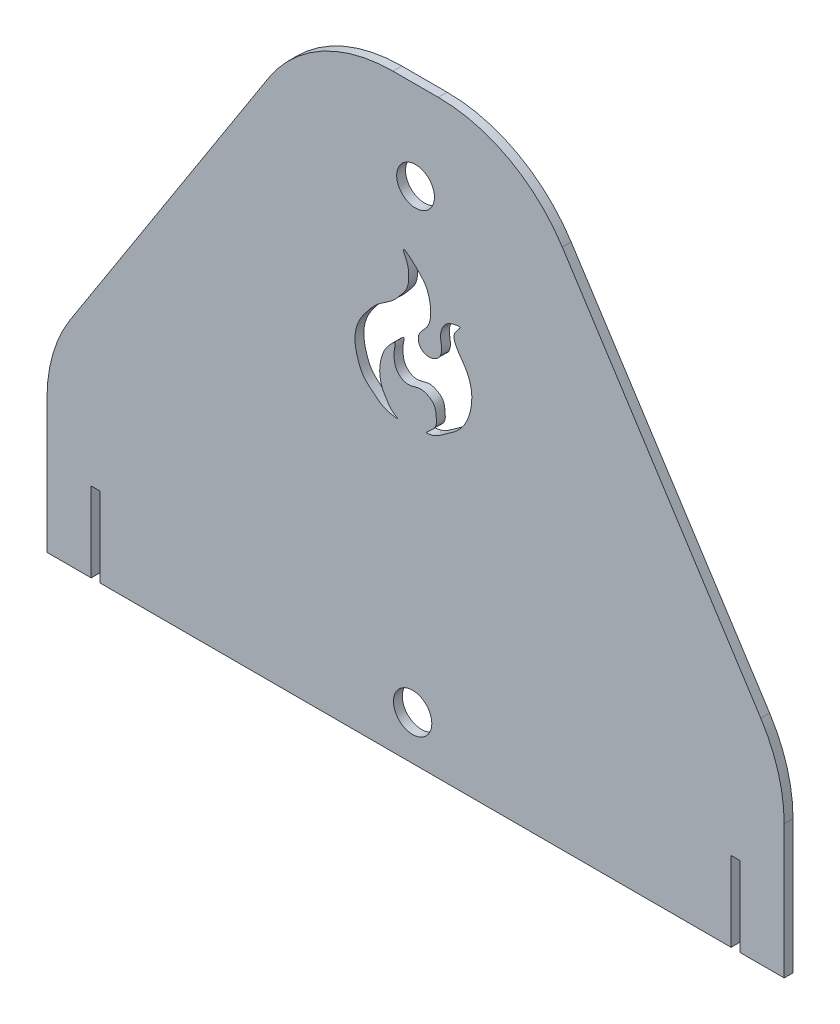
ISO-10303-21;
HEADER;
FILE_DESCRIPTION(('STEP AP214'),'2;1');
FILE_NAME('part.step','',(''),(''),'','','');
FILE_SCHEMA(('AUTOMOTIVE_DESIGN { 1 0 10303 214 1 1 1 1 }'));
ENDSEC;
DATA;
#1=APPLICATION_CONTEXT('core data for automotive mechanical design processes');
#2=APPLICATION_PROTOCOL_DEFINITION('international standard','automotive_design',2000,#1);
#3=PRODUCT_CONTEXT('',#1,'mechanical');
#4=PRODUCT('Part','Part','',(#3));
#5=PRODUCT_RELATED_PRODUCT_CATEGORY('part','',(#4));
#6=PRODUCT_DEFINITION_FORMATION('','',#4);
#7=PRODUCT_DEFINITION_CONTEXT('part definition',#1,'design');
#8=PRODUCT_DEFINITION('design','',#6,#7);
#9=PRODUCT_DEFINITION_SHAPE('','',#8);
#10=(LENGTH_UNIT() NAMED_UNIT(*) SI_UNIT(.MILLI.,.METRE.));
#11=(NAMED_UNIT(*) PLANE_ANGLE_UNIT() SI_UNIT($,.RADIAN.));
#12=(NAMED_UNIT(*) SI_UNIT($,.STERADIAN.) SOLID_ANGLE_UNIT());
#13=UNCERTAINTY_MEASURE_WITH_UNIT(LENGTH_MEASURE(1.E-05),#10,'distance_accuracy_value','');
#14=(GEOMETRIC_REPRESENTATION_CONTEXT(3) GLOBAL_UNCERTAINTY_ASSIGNED_CONTEXT((#13)) GLOBAL_UNIT_ASSIGNED_CONTEXT((#10,
#11,#12)) REPRESENTATION_CONTEXT('',''));
#15=CARTESIAN_POINT('',(0.,0.,0.));
#16=DIRECTION('',(0.,0.,1.));
#17=DIRECTION('',(1.,0.,0.));
#18=AXIS2_PLACEMENT_3D('',#15,#16,#17);
#19=CARTESIAN_POINT('',(0.,-100.,3.));
#20=DIRECTION('',(0.,1.,0.));
#21=DIRECTION('',(0.,0.,1.));
#22=AXIS2_PLACEMENT_3D('',#19,#20,#21);
#23=PLANE('',#22);
#24=DIRECTION('',(1.,0.,0.));
#25=VECTOR('',#24,1.);
#26=CARTESIAN_POINT('',(0.,-100.,3.));
#27=LINE('',#26,#25);
#28=CARTESIAN_POINT('',(110.,-100.,3.));
#29=VERTEX_POINT('',#28);
#30=CARTESIAN_POINT('',(125.,-100.,3.));
#31=VERTEX_POINT('',#30);
#32=EDGE_CURVE('E244',#29,#31,#27,.T.);
#33=ORIENTED_EDGE('',*,*,#32,.F.);
#34=DIRECTION('',(0.,0.,1.));
#35=VECTOR('',#34,1.);
#36=CARTESIAN_POINT('',(110.,-100.,0.));
#37=LINE('',#36,#35);
#38=CARTESIAN_POINT('',(110.,-100.,0.));
#39=VERTEX_POINT('',#38);
#40=EDGE_CURVE('E198',#39,#29,#37,.T.);
#41=ORIENTED_EDGE('',*,*,#40,.F.);
#42=DIRECTION('',(1.,0.,0.));
#43=VECTOR('',#42,1.);
#44=CARTESIAN_POINT('',(0.,-100.,0.));
#45=LINE('',#44,#43);
#46=CARTESIAN_POINT('',(125.,-100.,0.));
#47=VERTEX_POINT('',#46);
#48=EDGE_CURVE('E183',#39,#47,#45,.T.);
#49=ORIENTED_EDGE('',*,*,#48,.T.);
#50=DIRECTION('',(0.,0.,-1.));
#51=VECTOR('',#50,1.);
#52=CARTESIAN_POINT('',(125.,-100.,3.));
#53=LINE('',#52,#51);
#54=EDGE_CURVE('E252',#31,#47,#53,.T.);
#55=ORIENTED_EDGE('',*,*,#54,.F.);
#56=EDGE_LOOP('',(#33,#41,#49,#55));
#57=FACE_BOUND('',#56,.T.);
#58=ADVANCED_FACE('F37',(#57),#23,.F.);
#59=CARTESIAN_POINT('',(-125.,-100.,0.));
#60=VERTEX_POINT('',#59);
#61=CARTESIAN_POINT('',(-110.,-100.,0.));
#62=VERTEX_POINT('',#61);
#63=EDGE_CURVE('E266',#60,#62,#45,.T.);
#64=ORIENTED_EDGE('',*,*,#63,.T.);
#65=DIRECTION('',(0.,0.,1.));
#66=VECTOR('',#65,1.);
#67=CARTESIAN_POINT('',(-110.,-100.,0.));
#68=LINE('',#67,#66);
#69=CARTESIAN_POINT('',(-110.,-100.,3.));
#70=VERTEX_POINT('',#69);
#71=EDGE_CURVE('E213',#62,#70,#68,.T.);
#72=ORIENTED_EDGE('',*,*,#71,.T.);
#73=CARTESIAN_POINT('',(-125.,-100.,3.));
#74=VERTEX_POINT('',#73);
#75=EDGE_CURVE('E245',#74,#70,#27,.T.);
#76=ORIENTED_EDGE('',*,*,#75,.F.);
#77=DIRECTION('',(0.,0.,-1.));
#78=VECTOR('',#77,1.);
#79=CARTESIAN_POINT('',(-125.,-100.,3.));
#80=LINE('',#79,#78);
#81=EDGE_CURVE('E273',#74,#60,#80,.T.);
#82=ORIENTED_EDGE('',*,*,#81,.T.);
#83=EDGE_LOOP('',(#64,#72,#76,#82));
#84=FACE_BOUND('',#83,.T.);
#85=ADVANCED_FACE('F338',(#84),#23,.F.);
#86=CARTESIAN_POINT('',(70.2527075812274,45.1624548736462,3.));
#87=DIRECTION('',(0.841178475376554,0.540757591313499,0.));
#88=DIRECTION('',(-0.540757591313499,0.841178475376554,0.));
#89=AXIS2_PLACEMENT_3D('',#86,#87,#88);
#90=PLANE('',#89);
#91=DIRECTION('',(0.540757591313499,-0.841178475376554,0.));
#92=VECTOR('',#91,1.);
#93=CARTESIAN_POINT('',(70.2527075812274,45.1624548736462,3.));
#94=LINE('',#93,#92);
#95=CARTESIAN_POINT('',(49.7613631363518,77.0378795656749,3.));
#96=VERTEX_POINT('',#95);
#97=CARTESIAN_POINT('',(117.058923768828,-27.6472147515098,3.));
#98=VERTEX_POINT('',#97);
#99=EDGE_CURVE('E232',#96,#98,#94,.T.);
#100=ORIENTED_EDGE('',*,*,#99,.T.);
#101=DIRECTION('',(0.,0.,-1.));
#102=VECTOR('',#101,1.);
#103=CARTESIAN_POINT('',(117.058923768828,-27.6472147515098,3.));
#104=LINE('',#103,#102);
#105=CARTESIAN_POINT('',(117.058923768828,-27.6472147515098,0.));
#106=VERTEX_POINT('',#105);
#107=EDGE_CURVE('E302',#98,#106,#104,.T.);
#108=ORIENTED_EDGE('',*,*,#107,.T.);
#109=DIRECTION('',(0.540757591313499,-0.841178475376554,0.));
#110=VECTOR('',#109,1.);
#111=CARTESIAN_POINT('',(70.2527075812274,45.1624548736462,0.));
#112=LINE('',#111,#110);
#113=CARTESIAN_POINT('',(49.7613631363518,77.0378795656749,0.));
#114=VERTEX_POINT('',#113);
#115=EDGE_CURVE('E255',#114,#106,#112,.T.);
#116=ORIENTED_EDGE('',*,*,#115,.F.);
#117=DIRECTION('',(0.,0.,-1.));
#118=VECTOR('',#117,1.);
#119=CARTESIAN_POINT('',(49.7613631363518,77.0378795656749,3.));
#120=LINE('',#119,#118);
#121=EDGE_CURVE('E300',#114,#96,#120,.F.);
#122=ORIENTED_EDGE('',*,*,#121,.T.);
#123=EDGE_LOOP('',(#100,#108,#116,#122));
#124=FACE_BOUND('',#123,.T.);
#125=ADVANCED_FACE('F366',(#124),#90,.T.);
#126=CARTESIAN_POINT('',(0.,100.,3.));
#127=DIRECTION('',(0.,1.,0.));
#128=DIRECTION('',(0.,0.,1.));
#129=AXIS2_PLACEMENT_3D('',#126,#127,#128);
#130=PLANE('',#129);
#131=DIRECTION('',(1.,0.,0.));
#132=VECTOR('',#131,1.);
#133=CARTESIAN_POINT('',(0.,100.,3.));
#134=LINE('',#133,#132);
#135=CARTESIAN_POINT('',(-7.70243936752416,100.,3.));
#136=VERTEX_POINT('',#135);
#137=CARTESIAN_POINT('',(7.70243936752411,100.,3.));
#138=VERTEX_POINT('',#137);
#139=EDGE_CURVE('E236',#136,#138,#134,.T.);
#140=ORIENTED_EDGE('',*,*,#139,.T.);
#141=DIRECTION('',(0.,0.,-1.));
#142=VECTOR('',#141,1.);
#143=CARTESIAN_POINT('',(7.70243936752411,100.,3.));
#144=LINE('',#143,#142);
#145=CARTESIAN_POINT('',(7.70243936752411,100.,0.));
#146=VERTEX_POINT('',#145);
#147=EDGE_CURVE('E11',#138,#146,#144,.T.);
#148=ORIENTED_EDGE('',*,*,#147,.T.);
#149=DIRECTION('',(1.,0.,0.));
#150=VECTOR('',#149,1.);
#151=CARTESIAN_POINT('',(0.,100.,0.));
#152=LINE('',#151,#150);
#153=CARTESIAN_POINT('',(-7.70243936752416,100.,0.));
#154=VERTEX_POINT('',#153);
#155=EDGE_CURVE('E258',#154,#146,#152,.T.);
#156=ORIENTED_EDGE('',*,*,#155,.F.);
#157=DIRECTION('',(0.,0.,-1.));
#158=VECTOR('',#157,1.);
#159=CARTESIAN_POINT('',(-7.70243936752416,100.,3.));
#160=LINE('',#159,#158);
#161=EDGE_CURVE('E45',#154,#136,#160,.F.);
#162=ORIENTED_EDGE('',*,*,#161,.T.);
#163=EDGE_LOOP('',(#140,#148,#156,#162));
#164=FACE_BOUND('',#163,.T.);
#165=ADVANCED_FACE('F310',(#164),#130,.T.);
#166=CARTESIAN_POINT('',(-70.2527075812274,45.1624548736462,3.));
#167=DIRECTION('',(-0.841178475376553,0.540757591313499,0.));
#168=DIRECTION('',(-0.540757591313499,-0.841178475376554,0.));
#169=AXIS2_PLACEMENT_3D('',#166,#167,#168);
#170=PLANE('',#169);
#171=DIRECTION('',(0.540757591313499,0.841178475376554,0.));
#172=VECTOR('',#171,1.);
#173=CARTESIAN_POINT('',(-70.2527075812274,45.1624548736462,0.));
#174=LINE('',#173,#172);
#175=CARTESIAN_POINT('',(-117.058923768828,-27.6472147515097,0.));
#176=VERTEX_POINT('',#175);
#177=CARTESIAN_POINT('',(-49.7613631363518,77.0378795656749,0.));
#178=VERTEX_POINT('',#177);
#179=EDGE_CURVE('E261',#176,#178,#174,.T.);
#180=ORIENTED_EDGE('',*,*,#179,.F.);
#181=DIRECTION('',(0.,0.,-1.));
#182=VECTOR('',#181,1.);
#183=CARTESIAN_POINT('',(-117.058923768828,-27.6472147515097,3.));
#184=LINE('',#183,#182);
#185=CARTESIAN_POINT('',(-117.058923768828,-27.6472147515097,3.));
#186=VERTEX_POINT('',#185);
#187=EDGE_CURVE('E290',#176,#186,#184,.F.);
#188=ORIENTED_EDGE('',*,*,#187,.T.);
#189=DIRECTION('',(0.540757591313499,0.841178475376554,0.));
#190=VECTOR('',#189,1.);
#191=CARTESIAN_POINT('',(-70.2527075812274,45.1624548736462,3.));
#192=LINE('',#191,#190);
#193=CARTESIAN_POINT('',(-49.7613631363518,77.0378795656749,3.));
#194=VERTEX_POINT('',#193);
#195=EDGE_CURVE('E239',#186,#194,#192,.T.);
#196=ORIENTED_EDGE('',*,*,#195,.T.);
#197=DIRECTION('',(0.,0.,-1.));
#198=VECTOR('',#197,1.);
#199=CARTESIAN_POINT('',(-49.7613631363518,77.0378795656749,3.));
#200=LINE('',#199,#198);
#201=EDGE_CURVE('E287',#194,#178,#200,.T.);
#202=ORIENTED_EDGE('',*,*,#201,.T.);
#203=EDGE_LOOP('',(#180,#188,#196,#202));
#204=FACE_BOUND('',#203,.T.);
#205=ADVANCED_FACE('F323',(#204),#170,.T.);
#206=CARTESIAN_POINT('',(-125.,0.,3.));
#207=DIRECTION('',(1.,0.,0.));
#208=DIRECTION('',(0.,1.,0.));
#209=AXIS2_PLACEMENT_3D('',#206,#207,#208);
#210=PLANE('',#209);
#211=DIRECTION('',(0.,-1.,0.));
#212=VECTOR('',#211,1.);
#213=CARTESIAN_POINT('',(-125.,0.,3.));
#214=LINE('',#213,#212);
#215=CARTESIAN_POINT('',(-125.,-54.6850943171846,3.));
#216=VERTEX_POINT('',#215);
#217=EDGE_CURVE('E242',#216,#74,#214,.T.);
#218=ORIENTED_EDGE('',*,*,#217,.F.);
#219=DIRECTION('',(0.,0.,-1.));
#220=VECTOR('',#219,1.);
#221=CARTESIAN_POINT('',(-125.,-54.6850943171846,0.));
#222=LINE('',#221,#220);
#223=CARTESIAN_POINT('',(-125.,-54.6850943171846,0.));
#224=VERTEX_POINT('',#223);
#225=EDGE_CURVE('E276',#216,#224,#222,.T.);
#226=ORIENTED_EDGE('',*,*,#225,.T.);
#227=DIRECTION('',(0.,-1.,0.));
#228=VECTOR('',#227,1.);
#229=CARTESIAN_POINT('',(-125.,0.,0.));
#230=LINE('',#229,#228);
#231=EDGE_CURVE('E264',#224,#60,#230,.T.);
#232=ORIENTED_EDGE('',*,*,#231,.T.);
#233=ORIENTED_EDGE('',*,*,#81,.F.);
#234=EDGE_LOOP('',(#218,#226,#232,#233));
#235=FACE_BOUND('',#234,.T.);
#236=ADVANCED_FACE('F333',(#235),#210,.F.);
#237=CARTESIAN_POINT('',(-107.,-100.,0.));
#238=VERTEX_POINT('',#237);
#239=CARTESIAN_POINT('',(107.,-100.,0.));
#240=VERTEX_POINT('',#239);
#241=EDGE_CURVE('E269',#238,#240,#45,.T.);
#242=ORIENTED_EDGE('',*,*,#241,.T.);
#243=DIRECTION('',(0.,0.,1.));
#244=VECTOR('',#243,1.);
#245=CARTESIAN_POINT('',(107.,-100.,0.));
#246=LINE('',#245,#244);
#247=CARTESIAN_POINT('',(107.,-100.,3.));
#248=VERTEX_POINT('',#247);
#249=EDGE_CURVE('E201',#240,#248,#246,.T.);
#250=ORIENTED_EDGE('',*,*,#249,.T.);
#251=CARTESIAN_POINT('',(-107.,-100.,3.));
#252=VERTEX_POINT('',#251);
#253=EDGE_CURVE('E249',#252,#248,#27,.T.);
#254=ORIENTED_EDGE('',*,*,#253,.F.);
#255=DIRECTION('',(0.,0.,1.));
#256=VECTOR('',#255,1.);
#257=CARTESIAN_POINT('',(-107.,-100.,0.));
#258=LINE('',#257,#256);
#259=EDGE_CURVE('E225',#238,#252,#258,.T.);
#260=ORIENTED_EDGE('',*,*,#259,.F.);
#261=EDGE_LOOP('',(#242,#250,#254,#260));
#262=FACE_BOUND('',#261,.T.);
#263=ADVANCED_FACE('F350',(#262),#23,.F.);
#264=CARTESIAN_POINT('',(0.,70.,3.));
#265=DIRECTION('',(0.,0.,-1.));
#266=DIRECTION('',(-1.,0.,0.));
#267=AXIS2_PLACEMENT_3D('',#264,#265,#266);
#268=CYLINDRICAL_SURFACE('',#267,6.4);
#269=CARTESIAN_POINT('',(0.,70.,3.));
#270=DIRECTION('',(0.,0.,1.));
#271=DIRECTION('',(1.,0.,0.));
#272=AXIS2_PLACEMENT_3D('',#269,#270,#271);
#273=CIRCLE('',#272,6.4);
#274=CARTESIAN_POINT('',(6.39999999999995,70.,3.));
#275=VERTEX_POINT('',#274);
#276=EDGE_CURVE('E229',#275,#275,#273,.T.);
#277=ORIENTED_EDGE('',*,*,#276,.T.);
#278=EDGE_LOOP('',(#277));
#279=FACE_BOUND('',#278,.T.);
#280=CARTESIAN_POINT('',(0.,70.,0.));
#281=DIRECTION('',(0.,0.,1.));
#282=DIRECTION('',(1.,0.,0.));
#283=AXIS2_PLACEMENT_3D('',#280,#281,#282);
#284=CIRCLE('',#283,6.4);
#285=CARTESIAN_POINT('',(6.39999999999995,70.,0.));
#286=VERTEX_POINT('',#285);
#287=EDGE_CURVE('E222',#286,#286,#284,.T.);
#288=ORIENTED_EDGE('',*,*,#287,.F.);
#289=EDGE_LOOP('',(#288));
#290=FACE_BOUND('',#289,.T.);
#291=ADVANCED_FACE('F385',(#279,#290),#268,.F.);
#292=CARTESIAN_POINT('',(125.,0.,3.));
#293=DIRECTION('',(1.,0.,0.));
#294=DIRECTION('',(0.,1.,0.));
#295=AXIS2_PLACEMENT_3D('',#292,#293,#294);
#296=PLANE('',#295);
#297=DIRECTION('',(0.,-1.,0.));
#298=VECTOR('',#297,1.);
#299=CARTESIAN_POINT('',(125.,0.,0.));
#300=LINE('',#299,#298);
#301=CARTESIAN_POINT('',(125.,-54.6850943171847,0.));
#302=VERTEX_POINT('',#301);
#303=EDGE_CURVE('E233',#302,#47,#300,.T.);
#304=ORIENTED_EDGE('',*,*,#303,.F.);
#305=DIRECTION('',(0.,0.,-1.));
#306=VECTOR('',#305,1.);
#307=CARTESIAN_POINT('',(125.,-54.6850943171847,3.));
#308=LINE('',#307,#306);
#309=CARTESIAN_POINT('',(125.,-54.6850943171847,3.));
#310=VERTEX_POINT('',#309);
#311=EDGE_CURVE('E305',#302,#310,#308,.F.);
#312=ORIENTED_EDGE('',*,*,#311,.T.);
#313=DIRECTION('',(0.,-1.,0.));
#314=VECTOR('',#313,1.);
#315=CARTESIAN_POINT('',(125.,0.,3.));
#316=LINE('',#315,#314);
#317=EDGE_CURVE('E248',#310,#31,#316,.T.);
#318=ORIENTED_EDGE('',*,*,#317,.T.);
#319=ORIENTED_EDGE('',*,*,#54,.T.);
#320=EDGE_LOOP('',(#304,#312,#318,#319));
#321=FACE_BOUND('',#320,.T.);
#322=ADVANCED_FACE('F360',(#321),#296,.T.);
#323=CARTESIAN_POINT('',(0.,0.,3.));
#324=DIRECTION('',(0.,0.,1.));
#325=DIRECTION('',(1.,0.,0.));
#326=AXIS2_PLACEMENT_3D('',#323,#324,#325);
#327=PLANE('',#326);
#328=CARTESIAN_POINT('',(-0.999999999999987,-85.,3.));
#329=DIRECTION('',(0.,0.,1.));
#330=DIRECTION('',(1.,0.,0.));
#331=AXIS2_PLACEMENT_3D('',#328,#329,#330);
#332=CIRCLE('',#331,6.5);
#333=CARTESIAN_POINT('',(5.50000000000002,-85.,3.));
#334=VERTEX_POINT('',#333);
#335=EDGE_CURVE('E568',#334,#334,#332,.T.);
#336=ORIENTED_EDGE('',*,*,#335,.F.);
#337=EDGE_LOOP('',(#336));
#338=FACE_BOUND('',#337,.T.);
#339=CARTESIAN_POINT('',(-4.12725339671401,49.0959484469671,3.));
#340=CARTESIAN_POINT('',(-3.98707794969295,48.5465293594752,3.));
#341=CARTESIAN_POINT('',(-2.56154792500707,46.0235015709406,3.));
#342=CARTESIAN_POINT('',(-2.22360169040801,42.7831808845174,3.));
#343=CARTESIAN_POINT('',(-2.46538381453693,38.6612364866135,3.));
#344=CARTESIAN_POINT('',(-5.10503833260724,35.4720334912441,3.));
#345=CARTESIAN_POINT('',(-8.01681500923608,31.9589504181257,3.));
#346=CARTESIAN_POINT('',(-12.5492932982318,29.6768606026134,3.));
#347=CARTESIAN_POINT('',(-16.1389893501282,25.5373029322203,3.));
#348=CARTESIAN_POINT('',(-19.5571193880208,21.0626423139487,3.));
#349=CARTESIAN_POINT('',(-21.0143652570941,15.324992136359,3.));
#350=CARTESIAN_POINT('',(-19.8430561881023,10.0023436198541,3.));
#351=CARTESIAN_POINT('',(-17.9995434972235,5.07857505025242,3.));
#352=CARTESIAN_POINT('',(-13.5547666629663,1.67800809541478,3.));
#353=CARTESIAN_POINT('',(-10.8968295192266,-0.637239764509463,3.));
#354=CARTESIAN_POINT('',(-4.85431613423171,-1.70059907576659,3.));
#355=CARTESIAN_POINT('',(-8.52436173679336,0.199461893785471,3.));
#356=CARTESIAN_POINT('',(-9.5834237757312,2.2707244218301,3.));
#357=CARTESIAN_POINT('',(-11.4717053215345,5.03118445010933,3.));
#358=CARTESIAN_POINT('',(-12.2210732050776,8.32685950599297,3.));
#359=CARTESIAN_POINT('',(-12.1709086135857,11.7320350346255,3.));
#360=CARTESIAN_POINT('',(-11.1923589246509,15.3992184108924,3.));
#361=CARTESIAN_POINT('',(-10.0617483518492,17.8134479071054,3.));
#362=CARTESIAN_POINT('',(-6.44698519090501,21.6012675165652,3.));
#363=CARTESIAN_POINT('',(-7.32926682242971,18.2642493262938,3.));
#364=CARTESIAN_POINT('',(-7.35478032178391,16.4626112018925,3.));
#365=CARTESIAN_POINT('',(-7.15752582552984,15.1689811375015,3.));
#366=CARTESIAN_POINT('',(-7.01909850024471,13.8412187953574,3.));
#367=CARTESIAN_POINT('',(-5.97831782502443,12.1507380129293,3.));
#368=CARTESIAN_POINT('',(-4.4954541327037,10.9187757651564,3.));
#369=CARTESIAN_POINT('',(-2.72920796430243,10.5036594929682,3.));
#370=CARTESIAN_POINT('',(-0.700008666249059,10.7531556619096,3.));
#371=CARTESIAN_POINT('',(1.54726579070255,11.6841733957373,3.));
#372=CARTESIAN_POINT('',(4.253781924219,10.7980493525431,3.));
#373=CARTESIAN_POINT('',(6.7957034466938,8.95132695760773,3.));
#374=CARTESIAN_POINT('',(7.00836731261444,5.53802819933746,3.));
#375=CARTESIAN_POINT('',(7.30666589666588,2.10871319386036,3.));
#376=CARTESIAN_POINT('',(2.01639750528582,-1.09216902878568,3.));
#377=CARTESIAN_POINT('',(7.13968081730789,-0.0207215191973569,3.));
#378=CARTESIAN_POINT('',(9.50448389598061,2.09498890501786,3.));
#379=CARTESIAN_POINT('',(13.4297782983963,4.39853650923931,3.));
#380=CARTESIAN_POINT('',(17.0494990877415,8.36730891146637,3.));
#381=CARTESIAN_POINT('',(18.9977137772463,13.8219174932202,3.));
#382=CARTESIAN_POINT('',(19.2949027331674,19.8982352694827,3.));
#383=CARTESIAN_POINT('',(17.0835832339629,25.4045225890777,3.));
#384=CARTESIAN_POINT('',(14.0512344145749,28.8367550445736,3.));
#385=CARTESIAN_POINT('',(12.6563813410722,32.4523684440979,3.));
#386=CARTESIAN_POINT('',(13.6697440635928,34.3506521592627,3.));
#387=CARTESIAN_POINT('',(15.9552968634335,36.6231383779325,3.));
#388=CARTESIAN_POINT('',(11.8692486731837,35.7996200198742,3.));
#389=CARTESIAN_POINT('',(9.54573523394233,34.4084604400302,3.));
#390=CARTESIAN_POINT('',(8.12426283239527,30.821898129246,3.));
#391=CARTESIAN_POINT('',(8.90277250615677,27.5361356308487,3.));
#392=CARTESIAN_POINT('',(8.80183827732296,24.1342752813737,3.));
#393=CARTESIAN_POINT('',(6.2963971760399,22.2984932184813,3.));
#394=CARTESIAN_POINT('',(3.75880469421564,21.9907668914702,3.));
#395=CARTESIAN_POINT('',(1.56548509423479,23.2148650972399,3.));
#396=CARTESIAN_POINT('',(0.645683902285439,25.5574371214672,3.));
#397=CARTESIAN_POINT('',(1.44551686885422,28.2990549363111,3.));
#398=CARTESIAN_POINT('',(4.29908583102338,30.4110262511548,3.));
#399=CARTESIAN_POINT('',(5.51587751965564,35.0899875570148,3.));
#400=CARTESIAN_POINT('',(4.49982381028226,40.934602708109,3.));
#401=CARTESIAN_POINT('',(2.39650316305369,44.6254700172544,3.));
#402=CARTESIAN_POINT('',(-4.5182924223943,50.6286298774796,3.));
#403=CARTESIAN_POINT('',(-4.12725339671401,49.0959484469671,3.));
#404=B_SPLINE_CURVE_WITH_KNOTS('',3,(#339,#340,#341,#342,#343,#344,#345,#346,#347,#348,#349,
#350,#351,#352,#353,#354,#355,#356,#357,#358,#359,#360,#361,#362,#363,#364,#365,#366,#367,#368,
#369,#370,#371,#372,#373,#374,#375,#376,#377,#378,#379,#380,#381,#382,#383,#384,#385,#386,#387,
#388,#389,#390,#391,#392,#393,#394,#395,#396,#397,#398,#399,#400,#401,#402,#403),.UNSPECIFIED.,
.T.,.F.,(4,1,1,1,1,1,1,1,1,1,1,1,1,1,1,1,1,1,1,1,1,1,1,1,1,1,1,1,1,1,1,1,1,1,1,1,1,1,1,1,1,1,1,
1,1,1,1,1,1,1,1,1,1,1,1,1,1,1,1,1,1,1,4),(0.,0.011114111019035,0.0245873707818223,
0.0400773707193955,0.0550857900431032,0.0703646128201584,0.0916565839116477,0.111160034484304,
0.131942050183432,0.155226155463143,0.175285614912486,0.192984258002717,0.21414709386404,
0.233250826792014,0.245061707746368,0.252724431085502,0.26400469869646,0.274847542596833,
0.289360739598741,0.301591105017917,0.313643078156965,0.330068326454436,0.340960994138866,
0.347770076416226,0.357704028440235,0.359866782905986,0.369397621073736,0.378219282077832,
0.388786570706384,0.397662104950197,0.404600906339244,0.419429226672858,0.432660592344865,
0.445655664621459,0.464078809470296,0.47985721065022,0.499391806834321,0.512735468963105,
0.529774566860621,0.55429478669409,0.578004522368771,0.609803978884637,0.639155653653278,
0.668005658439941,0.695677007971753,0.709998366240669,0.720343400721268,0.730015674981377,
0.742142618477788,0.758246227570176,0.777479564094618,0.792731805865154,0.809819238537619,
0.824322515115591,0.835074277091286,0.846978051874076,0.859222355622795,0.869940813144779,
0.887577379141998,0.910066965194994,0.939312882476755,0.968995631998713,1.),.UNSPECIFIED.);
#405=CARTESIAN_POINT('',(-4.12725339671401,49.0959484469671,3.));
#406=VERTEX_POINT('',#405);
#407=EDGE_CURVE('E189',#406,#406,#404,.T.);
#408=ORIENTED_EDGE('',*,*,#407,.F.);
#409=EDGE_LOOP('',(#408));
#410=FACE_BOUND('',#409,.T.);
#411=DIRECTION('',(0.,1.,0.));
#412=VECTOR('',#411,1.);
#413=CARTESIAN_POINT('',(110.,-100.,3.));
#414=LINE('',#413,#412);
#415=CARTESIAN_POINT('',(110.,-73.0000000000001,3.));
#416=VERTEX_POINT('',#415);
#417=EDGE_CURVE('E168',#29,#416,#414,.T.);
#418=ORIENTED_EDGE('',*,*,#417,.F.);
#419=ORIENTED_EDGE('',*,*,#32,.T.);
#420=ORIENTED_EDGE('',*,*,#317,.F.);
#421=CARTESIAN_POINT('',(75.,-54.6850943171847,3.));
#422=DIRECTION('',(0.,0.,1.));
#423=DIRECTION('',(1.,0.,0.));
#424=AXIS2_PLACEMENT_3D('',#421,#422,#423);
#425=CIRCLE('',#424,50.);
#426=EDGE_CURVE('E296',#310,#98,#425,.T.);
#427=ORIENTED_EDGE('',*,*,#426,.T.);
#428=ORIENTED_EDGE('',*,*,#99,.F.);
#429=CARTESIAN_POINT('',(7.70243936752411,50.,3.));
#430=DIRECTION('',(0.,0.,1.));
#431=DIRECTION('',(1.,0.,0.));
#432=AXIS2_PLACEMENT_3D('',#429,#430,#431);
#433=CIRCLE('',#432,50.);
#434=EDGE_CURVE('E294',#96,#138,#433,.T.);
#435=ORIENTED_EDGE('',*,*,#434,.T.);
#436=ORIENTED_EDGE('',*,*,#139,.F.);
#437=CARTESIAN_POINT('',(-7.70243936752416,50.,3.));
#438=DIRECTION('',(0.,0.,1.));
#439=DIRECTION('',(1.,0.,0.));
#440=AXIS2_PLACEMENT_3D('',#437,#438,#439);
#441=CIRCLE('',#440,50.);
#442=EDGE_CURVE('E292',#136,#194,#441,.T.);
#443=ORIENTED_EDGE('',*,*,#442,.T.);
#444=ORIENTED_EDGE('',*,*,#195,.F.);
#445=CARTESIAN_POINT('',(-75.,-54.6850943171846,3.));
#446=DIRECTION('',(0.,0.,1.));
#447=DIRECTION('',(1.,0.,0.));
#448=AXIS2_PLACEMENT_3D('',#445,#446,#447);
#449=CIRCLE('',#448,50.);
#450=EDGE_CURVE('E298',#186,#216,#449,.T.);
#451=ORIENTED_EDGE('',*,*,#450,.T.);
#452=ORIENTED_EDGE('',*,*,#217,.T.);
#453=ORIENTED_EDGE('',*,*,#75,.T.);
#454=DIRECTION('',(0.,-1.,0.));
#455=VECTOR('',#454,1.);
#456=CARTESIAN_POINT('',(-110.,-100.,3.));
#457=LINE('',#456,#455);
#458=CARTESIAN_POINT('',(-110.,-73.0000000000001,3.));
#459=VERTEX_POINT('',#458);
#460=EDGE_CURVE('E200',#459,#70,#457,.T.);
#461=ORIENTED_EDGE('',*,*,#460,.F.);
#462=DIRECTION('',(-1.,0.,0.));
#463=VECTOR('',#462,1.);
#464=CARTESIAN_POINT('',(-110.,-73.0000000000001,3.));
#465=LINE('',#464,#463);
#466=CARTESIAN_POINT('',(-107.,-73.0000000000001,3.));
#467=VERTEX_POINT('',#466);
#468=EDGE_CURVE('E209',#467,#459,#465,.T.);
#469=ORIENTED_EDGE('',*,*,#468,.F.);
#470=DIRECTION('',(0.,1.,0.));
#471=VECTOR('',#470,1.);
#472=CARTESIAN_POINT('',(-107.,-100.,3.));
#473=LINE('',#472,#471);
#474=EDGE_CURVE('E215',#252,#467,#473,.T.);
#475=ORIENTED_EDGE('',*,*,#474,.F.);
#476=ORIENTED_EDGE('',*,*,#253,.T.);
#477=DIRECTION('',(0.,-1.,0.));
#478=VECTOR('',#477,1.);
#479=CARTESIAN_POINT('',(107.,-100.,3.));
#480=LINE('',#479,#478);
#481=CARTESIAN_POINT('',(107.,-73.0000000000001,3.));
#482=VERTEX_POINT('',#481);
#483=EDGE_CURVE('E184',#482,#248,#480,.T.);
#484=ORIENTED_EDGE('',*,*,#483,.F.);
#485=DIRECTION('',(-1.,0.,0.));
#486=VECTOR('',#485,1.);
#487=CARTESIAN_POINT('',(110.,-73.0000000000001,3.));
#488=LINE('',#487,#486);
#489=EDGE_CURVE('E186',#416,#482,#488,.T.);
#490=ORIENTED_EDGE('',*,*,#489,.F.);
#491=EDGE_LOOP('',(#418,#419,#420,#427,#428,#435,#436,#443,#444,#451,#452,#453,#461,#469,#475,
#476,#484,#490));
#492=FACE_BOUND('',#491,.T.);
#493=ORIENTED_EDGE('',*,*,#276,.F.);
#494=EDGE_LOOP('',(#493));
#495=FACE_BOUND('',#494,.T.);
#496=ADVANCED_FACE('F315',(#338,#410,#492,#495),#327,.T.);
#497=CARTESIAN_POINT('',(0.,0.,0.));
#498=DIRECTION('',(0.,0.,1.));
#499=DIRECTION('',(1.,0.,0.));
#500=AXIS2_PLACEMENT_3D('',#497,#498,#499);
#501=PLANE('',#500);
#502=CARTESIAN_POINT('',(-0.999999999999987,-85.,0.));
#503=DIRECTION('',(0.,0.,1.));
#504=DIRECTION('',(1.,0.,0.));
#505=AXIS2_PLACEMENT_3D('',#502,#503,#504);
#506=CIRCLE('',#505,6.5);
#507=CARTESIAN_POINT('',(5.50000000000002,-85.,0.));
#508=VERTEX_POINT('',#507);
#509=EDGE_CURVE('E574',#508,#508,#506,.T.);
#510=ORIENTED_EDGE('',*,*,#509,.T.);
#511=EDGE_LOOP('',(#510));
#512=FACE_BOUND('',#511,.T.);
#513=CARTESIAN_POINT('',(-4.12725339671401,49.0959484469671,0.));
#514=CARTESIAN_POINT('',(-3.98707794969295,48.5465293594752,0.));
#515=CARTESIAN_POINT('',(-2.56154792500707,46.0235015709406,0.));
#516=CARTESIAN_POINT('',(-2.22360169040801,42.7831808845174,0.));
#517=CARTESIAN_POINT('',(-2.46538381453693,38.6612364866135,0.));
#518=CARTESIAN_POINT('',(-5.10503833260724,35.4720334912441,0.));
#519=CARTESIAN_POINT('',(-8.01681500923608,31.9589504181257,0.));
#520=CARTESIAN_POINT('',(-12.5492932982318,29.6768606026134,0.));
#521=CARTESIAN_POINT('',(-16.1389893501282,25.5373029322203,0.));
#522=CARTESIAN_POINT('',(-19.5571193880208,21.0626423139487,0.));
#523=CARTESIAN_POINT('',(-21.0143652570941,15.324992136359,0.));
#524=CARTESIAN_POINT('',(-19.8430561881023,10.0023436198541,0.));
#525=CARTESIAN_POINT('',(-17.9995434972235,5.07857505025242,0.));
#526=CARTESIAN_POINT('',(-13.5547666629663,1.67800809541478,0.));
#527=CARTESIAN_POINT('',(-10.8968295192266,-0.637239764509463,0.));
#528=CARTESIAN_POINT('',(-4.85431613423171,-1.70059907576659,0.));
#529=CARTESIAN_POINT('',(-8.52436173679336,0.199461893785471,0.));
#530=CARTESIAN_POINT('',(-9.5834237757312,2.2707244218301,0.));
#531=CARTESIAN_POINT('',(-11.4717053215345,5.03118445010933,0.));
#532=CARTESIAN_POINT('',(-12.2210732050776,8.32685950599297,0.));
#533=CARTESIAN_POINT('',(-12.1709086135857,11.7320350346255,0.));
#534=CARTESIAN_POINT('',(-11.1923589246509,15.3992184108924,0.));
#535=CARTESIAN_POINT('',(-10.0617483518492,17.8134479071054,0.));
#536=CARTESIAN_POINT('',(-6.44698519090501,21.6012675165652,0.));
#537=CARTESIAN_POINT('',(-7.32926682242971,18.2642493262938,0.));
#538=CARTESIAN_POINT('',(-7.35478032178391,16.4626112018925,0.));
#539=CARTESIAN_POINT('',(-7.15752582552984,15.1689811375015,0.));
#540=CARTESIAN_POINT('',(-7.01909850024471,13.8412187953574,0.));
#541=CARTESIAN_POINT('',(-5.97831782502443,12.1507380129293,0.));
#542=CARTESIAN_POINT('',(-4.4954541327037,10.9187757651564,0.));
#543=CARTESIAN_POINT('',(-2.72920796430243,10.5036594929682,0.));
#544=CARTESIAN_POINT('',(-0.700008666249059,10.7531556619096,0.));
#545=CARTESIAN_POINT('',(1.54726579070255,11.6841733957373,0.));
#546=CARTESIAN_POINT('',(4.253781924219,10.7980493525431,0.));
#547=CARTESIAN_POINT('',(6.7957034466938,8.95132695760773,0.));
#548=CARTESIAN_POINT('',(7.00836731261444,5.53802819933746,0.));
#549=CARTESIAN_POINT('',(7.30666589666588,2.10871319386036,0.));
#550=CARTESIAN_POINT('',(2.01639750528582,-1.09216902878568,0.));
#551=CARTESIAN_POINT('',(7.13968081730789,-0.0207215191973569,0.));
#552=CARTESIAN_POINT('',(9.50448389598061,2.09498890501786,0.));
#553=CARTESIAN_POINT('',(13.4297782983963,4.39853650923931,0.));
#554=CARTESIAN_POINT('',(17.0494990877415,8.36730891146637,0.));
#555=CARTESIAN_POINT('',(18.9977137772463,13.8219174932202,0.));
#556=CARTESIAN_POINT('',(19.2949027331674,19.8982352694827,0.));
#557=CARTESIAN_POINT('',(17.0835832339629,25.4045225890777,0.));
#558=CARTESIAN_POINT('',(14.0512344145749,28.8367550445736,0.));
#559=CARTESIAN_POINT('',(12.6563813410722,32.4523684440979,0.));
#560=CARTESIAN_POINT('',(13.6697440635928,34.3506521592627,0.));
#561=CARTESIAN_POINT('',(15.9552968634335,36.6231383779325,0.));
#562=CARTESIAN_POINT('',(11.8692486731837,35.7996200198742,0.));
#563=CARTESIAN_POINT('',(9.54573523394233,34.4084604400302,0.));
#564=CARTESIAN_POINT('',(8.12426283239527,30.821898129246,0.));
#565=CARTESIAN_POINT('',(8.90277250615677,27.5361356308487,0.));
#566=CARTESIAN_POINT('',(8.80183827732296,24.1342752813737,0.));
#567=CARTESIAN_POINT('',(6.2963971760399,22.2984932184813,0.));
#568=CARTESIAN_POINT('',(3.75880469421564,21.9907668914702,0.));
#569=CARTESIAN_POINT('',(1.56548509423479,23.2148650972399,0.));
#570=CARTESIAN_POINT('',(0.645683902285439,25.5574371214672,0.));
#571=CARTESIAN_POINT('',(1.44551686885422,28.2990549363111,0.));
#572=CARTESIAN_POINT('',(4.29908583102338,30.4110262511548,0.));
#573=CARTESIAN_POINT('',(5.51587751965564,35.0899875570148,0.));
#574=CARTESIAN_POINT('',(4.49982381028226,40.934602708109,0.));
#575=CARTESIAN_POINT('',(2.39650316305369,44.6254700172544,0.));
#576=CARTESIAN_POINT('',(-4.5182924223943,50.6286298774796,0.));
#577=CARTESIAN_POINT('',(-4.12725339671401,49.0959484469671,0.));
#578=B_SPLINE_CURVE_WITH_KNOTS('',3,(#513,#514,#515,#516,#517,#518,#519,#520,#521,#522,#523,
#524,#525,#526,#527,#528,#529,#530,#531,#532,#533,#534,#535,#536,#537,#538,#539,#540,#541,#542,
#543,#544,#545,#546,#547,#548,#549,#550,#551,#552,#553,#554,#555,#556,#557,#558,#559,#560,#561,
#562,#563,#564,#565,#566,#567,#568,#569,#570,#571,#572,#573,#574,#575,#576,#577),.UNSPECIFIED.,
.T.,.F.,(4,1,1,1,1,1,1,1,1,1,1,1,1,1,1,1,1,1,1,1,1,1,1,1,1,1,1,1,1,1,1,1,1,1,1,1,1,1,1,1,1,1,1,
1,1,1,1,1,1,1,1,1,1,1,1,1,1,1,1,1,1,1,4),(0.,0.011114111019035,0.0245873707818223,
0.0400773707193955,0.0550857900431032,0.0703646128201584,0.0916565839116477,0.111160034484304,
0.131942050183432,0.155226155463143,0.175285614912486,0.192984258002717,0.21414709386404,
0.233250826792014,0.245061707746368,0.252724431085502,0.26400469869646,0.274847542596833,
0.289360739598741,0.301591105017917,0.313643078156965,0.330068326454436,0.340960994138866,
0.347770076416226,0.357704028440235,0.359866782905986,0.369397621073736,0.378219282077832,
0.388786570706384,0.397662104950197,0.404600906339244,0.419429226672858,0.432660592344865,
0.445655664621459,0.464078809470296,0.47985721065022,0.499391806834321,0.512735468963105,
0.529774566860621,0.55429478669409,0.578004522368771,0.609803978884637,0.639155653653278,
0.668005658439941,0.695677007971753,0.709998366240669,0.720343400721268,0.730015674981377,
0.742142618477788,0.758246227570176,0.777479564094618,0.792731805865154,0.809819238537619,
0.824322515115591,0.835074277091286,0.846978051874076,0.859222355622795,0.869940813144779,
0.887577379141998,0.910066965194994,0.939312882476755,0.968995631998713,1.),.UNSPECIFIED.);
#579=CARTESIAN_POINT('',(-4.12725339671401,49.0959484469671,0.));
#580=VERTEX_POINT('',#579);
#581=EDGE_CURVE('E196',#580,#580,#578,.T.);
#582=ORIENTED_EDGE('',*,*,#581,.T.);
#583=EDGE_LOOP('',(#582));
#584=FACE_BOUND('',#583,.T.);
#585=ORIENTED_EDGE('',*,*,#48,.F.);
#586=DIRECTION('',(0.,1.,0.));
#587=VECTOR('',#586,1.);
#588=CARTESIAN_POINT('',(110.,-100.,0.));
#589=LINE('',#588,#587);
#590=CARTESIAN_POINT('',(110.,-73.0000000000001,0.));
#591=VERTEX_POINT('',#590);
#592=EDGE_CURVE('E165',#39,#591,#589,.T.);
#593=ORIENTED_EDGE('',*,*,#592,.T.);
#594=DIRECTION('',(-1.,0.,0.));
#595=VECTOR('',#594,1.);
#596=CARTESIAN_POINT('',(110.,-73.0000000000001,0.));
#597=LINE('',#596,#595);
#598=CARTESIAN_POINT('',(107.,-73.0000000000001,0.));
#599=VERTEX_POINT('',#598);
#600=EDGE_CURVE('E175',#591,#599,#597,.T.);
#601=ORIENTED_EDGE('',*,*,#600,.T.);
#602=DIRECTION('',(0.,-1.,0.));
#603=VECTOR('',#602,1.);
#604=CARTESIAN_POINT('',(107.,-100.,0.));
#605=LINE('',#604,#603);
#606=EDGE_CURVE('E52',#599,#240,#605,.T.);
#607=ORIENTED_EDGE('',*,*,#606,.T.);
#608=ORIENTED_EDGE('',*,*,#241,.F.);
#609=DIRECTION('',(0.,1.,0.));
#610=VECTOR('',#609,1.);
#611=CARTESIAN_POINT('',(-107.,-100.,0.));
#612=LINE('',#611,#610);
#613=CARTESIAN_POINT('',(-107.,-73.0000000000001,0.));
#614=VERTEX_POINT('',#613);
#615=EDGE_CURVE('E208',#238,#614,#612,.T.);
#616=ORIENTED_EDGE('',*,*,#615,.T.);
#617=DIRECTION('',(-1.,0.,0.));
#618=VECTOR('',#617,1.);
#619=CARTESIAN_POINT('',(-110.,-73.0000000000001,0.));
#620=LINE('',#619,#618);
#621=CARTESIAN_POINT('',(-110.,-73.0000000000001,0.));
#622=VERTEX_POINT('',#621);
#623=EDGE_CURVE('E60',#614,#622,#620,.T.);
#624=ORIENTED_EDGE('',*,*,#623,.T.);
#625=DIRECTION('',(0.,-1.,0.));
#626=VECTOR('',#625,1.);
#627=CARTESIAN_POINT('',(-110.,-100.,0.));
#628=LINE('',#627,#626);
#629=EDGE_CURVE('E205',#622,#62,#628,.T.);
#630=ORIENTED_EDGE('',*,*,#629,.T.);
#631=ORIENTED_EDGE('',*,*,#63,.F.);
#632=ORIENTED_EDGE('',*,*,#231,.F.);
#633=CARTESIAN_POINT('',(-75.,-54.6850943171846,0.));
#634=DIRECTION('',(0.,0.,1.));
#635=DIRECTION('',(1.,0.,0.));
#636=AXIS2_PLACEMENT_3D('',#633,#634,#635);
#637=CIRCLE('',#636,50.);
#638=EDGE_CURVE('E285',#224,#176,#637,.F.);
#639=ORIENTED_EDGE('',*,*,#638,.T.);
#640=ORIENTED_EDGE('',*,*,#179,.T.);
#641=CARTESIAN_POINT('',(-7.70243936752416,50.,0.));
#642=DIRECTION('',(0.,0.,1.));
#643=DIRECTION('',(1.,0.,0.));
#644=AXIS2_PLACEMENT_3D('',#641,#642,#643);
#645=CIRCLE('',#644,50.);
#646=EDGE_CURVE('E279',#178,#154,#645,.F.);
#647=ORIENTED_EDGE('',*,*,#646,.T.);
#648=ORIENTED_EDGE('',*,*,#155,.T.);
#649=CARTESIAN_POINT('',(7.70243936752411,50.,0.));
#650=DIRECTION('',(0.,0.,1.));
#651=DIRECTION('',(1.,0.,0.));
#652=AXIS2_PLACEMENT_3D('',#649,#650,#651);
#653=CIRCLE('',#652,50.);
#654=EDGE_CURVE('E281',#146,#114,#653,.F.);
#655=ORIENTED_EDGE('',*,*,#654,.T.);
#656=ORIENTED_EDGE('',*,*,#115,.T.);
#657=CARTESIAN_POINT('',(75.,-54.6850943171847,0.));
#658=DIRECTION('',(0.,0.,1.));
#659=DIRECTION('',(1.,0.,0.));
#660=AXIS2_PLACEMENT_3D('',#657,#658,#659);
#661=CIRCLE('',#660,50.);
#662=EDGE_CURVE('E283',#106,#302,#661,.F.);
#663=ORIENTED_EDGE('',*,*,#662,.T.);
#664=ORIENTED_EDGE('',*,*,#303,.T.);
#665=EDGE_LOOP('',(#585,#593,#601,#607,#608,#616,#624,#630,#631,#632,#639,#640,#647,#648,#655,
#656,#663,#664));
#666=FACE_BOUND('',#665,.T.);
#667=ORIENTED_EDGE('',*,*,#287,.T.);
#668=EDGE_LOOP('',(#667));
#669=FACE_BOUND('',#668,.T.);
#670=ADVANCED_FACE('F180',(#512,#584,#666,#669),#501,.F.);
#671=CARTESIAN_POINT('',(-75.,-54.6850943171846,3.));
#672=DIRECTION('',(0.,0.,1.));
#673=DIRECTION('',(1.,0.,0.));
#674=AXIS2_PLACEMENT_3D('',#671,#672,#673);
#675=CYLINDRICAL_SURFACE('',#674,50.);
#676=ORIENTED_EDGE('',*,*,#450,.F.);
#677=ORIENTED_EDGE('',*,*,#187,.F.);
#678=ORIENTED_EDGE('',*,*,#638,.F.);
#679=ORIENTED_EDGE('',*,*,#225,.F.);
#680=EDGE_LOOP('',(#676,#677,#678,#679));
#681=FACE_BOUND('',#680,.T.);
#682=ADVANCED_FACE('F330',(#681),#675,.T.);
#683=CARTESIAN_POINT('',(75.,-54.6850943171847,3.));
#684=DIRECTION('',(0.,0.,-1.));
#685=DIRECTION('',(-1.,0.,0.));
#686=AXIS2_PLACEMENT_3D('',#683,#684,#685);
#687=CYLINDRICAL_SURFACE('',#686,50.);
#688=ORIENTED_EDGE('',*,*,#426,.F.);
#689=ORIENTED_EDGE('',*,*,#311,.F.);
#690=ORIENTED_EDGE('',*,*,#662,.F.);
#691=ORIENTED_EDGE('',*,*,#107,.F.);
#692=EDGE_LOOP('',(#688,#689,#690,#691));
#693=FACE_BOUND('',#692,.T.);
#694=ADVANCED_FACE('F363',(#693),#687,.T.);
#695=CARTESIAN_POINT('',(7.70243936752411,50.,3.));
#696=DIRECTION('',(0.,0.,-1.));
#697=DIRECTION('',(-1.,0.,0.));
#698=AXIS2_PLACEMENT_3D('',#695,#696,#697);
#699=CYLINDRICAL_SURFACE('',#698,50.);
#700=ORIENTED_EDGE('',*,*,#434,.F.);
#701=ORIENTED_EDGE('',*,*,#121,.F.);
#702=ORIENTED_EDGE('',*,*,#654,.F.);
#703=ORIENTED_EDGE('',*,*,#147,.F.);
#704=EDGE_LOOP('',(#700,#701,#702,#703));
#705=FACE_BOUND('',#704,.T.);
#706=ADVANCED_FACE('F370',(#705),#699,.T.);
#707=CARTESIAN_POINT('',(-7.70243936752416,50.,3.));
#708=DIRECTION('',(0.,0.,-1.));
#709=DIRECTION('',(-1.,0.,0.));
#710=AXIS2_PLACEMENT_3D('',#707,#708,#709);
#711=CYLINDRICAL_SURFACE('',#710,50.);
#712=ORIENTED_EDGE('',*,*,#442,.F.);
#713=ORIENTED_EDGE('',*,*,#161,.F.);
#714=ORIENTED_EDGE('',*,*,#646,.F.);
#715=ORIENTED_EDGE('',*,*,#201,.F.);
#716=EDGE_LOOP('',(#712,#713,#714,#715));
#717=FACE_BOUND('',#716,.T.);
#718=ADVANCED_FACE('F39',(#717),#711,.T.);
#719=CARTESIAN_POINT('',(-110.,-100.,0.));
#720=DIRECTION('',(-1.,0.,0.));
#721=DIRECTION('',(0.,-1.,0.));
#722=AXIS2_PLACEMENT_3D('',#719,#720,#721);
#723=PLANE('',#722);
#724=ORIENTED_EDGE('',*,*,#460,.T.);
#725=ORIENTED_EDGE('',*,*,#71,.F.);
#726=ORIENTED_EDGE('',*,*,#629,.F.);
#727=DIRECTION('',(0.,0.,1.));
#728=VECTOR('',#727,1.);
#729=CARTESIAN_POINT('',(-110.,-73.0000000000001,0.));
#730=LINE('',#729,#728);
#731=EDGE_CURVE('E220',#622,#459,#730,.T.);
#732=ORIENTED_EDGE('',*,*,#731,.T.);
#733=EDGE_LOOP('',(#724,#725,#726,#732));
#734=FACE_BOUND('',#733,.T.);
#735=ADVANCED_FACE('F341',(#734),#723,.F.);
#736=CARTESIAN_POINT('',(-110.,-73.0000000000001,0.));
#737=DIRECTION('',(0.,1.,0.));
#738=DIRECTION('',(0.,0.,1.));
#739=AXIS2_PLACEMENT_3D('',#736,#737,#738);
#740=PLANE('',#739);
#741=ORIENTED_EDGE('',*,*,#468,.T.);
#742=ORIENTED_EDGE('',*,*,#731,.F.);
#743=ORIENTED_EDGE('',*,*,#623,.F.);
#744=DIRECTION('',(0.,0.,1.));
#745=VECTOR('',#744,1.);
#746=CARTESIAN_POINT('',(-107.,-73.0000000000001,0.));
#747=LINE('',#746,#745);
#748=EDGE_CURVE('E223',#614,#467,#747,.T.);
#749=ORIENTED_EDGE('',*,*,#748,.T.);
#750=EDGE_LOOP('',(#741,#742,#743,#749));
#751=FACE_BOUND('',#750,.T.);
#752=ADVANCED_FACE('F474',(#751),#740,.F.);
#753=CARTESIAN_POINT('',(-107.,-100.,0.));
#754=DIRECTION('',(1.,0.,0.));
#755=DIRECTION('',(0.,0.,-1.));
#756=AXIS2_PLACEMENT_3D('',#753,#754,#755);
#757=PLANE('',#756);
#758=ORIENTED_EDGE('',*,*,#474,.T.);
#759=ORIENTED_EDGE('',*,*,#748,.F.);
#760=ORIENTED_EDGE('',*,*,#615,.F.);
#761=ORIENTED_EDGE('',*,*,#259,.T.);
#762=EDGE_LOOP('',(#758,#759,#760,#761));
#763=FACE_BOUND('',#762,.T.);
#764=ADVANCED_FACE('F346',(#763),#757,.F.);
#765=CARTESIAN_POINT('',(110.,-100.,0.));
#766=DIRECTION('',(1.,0.,0.));
#767=DIRECTION('',(0.,1.,0.));
#768=AXIS2_PLACEMENT_3D('',#765,#766,#767);
#769=PLANE('',#768);
#770=ORIENTED_EDGE('',*,*,#417,.T.);
#771=DIRECTION('',(0.,0.,1.));
#772=VECTOR('',#771,1.);
#773=CARTESIAN_POINT('',(110.,-73.0000000000001,0.));
#774=LINE('',#773,#772);
#775=EDGE_CURVE('E161',#591,#416,#774,.T.);
#776=ORIENTED_EDGE('',*,*,#775,.F.);
#777=ORIENTED_EDGE('',*,*,#592,.F.);
#778=ORIENTED_EDGE('',*,*,#40,.T.);
#779=EDGE_LOOP('',(#770,#776,#777,#778));
#780=FACE_BOUND('',#779,.T.);
#781=ADVANCED_FACE('F163',(#780),#769,.F.);
#782=CARTESIAN_POINT('',(107.,-100.,0.));
#783=DIRECTION('',(-1.,0.,0.));
#784=DIRECTION('',(0.,0.,1.));
#785=AXIS2_PLACEMENT_3D('',#782,#783,#784);
#786=PLANE('',#785);
#787=ORIENTED_EDGE('',*,*,#483,.T.);
#788=ORIENTED_EDGE('',*,*,#249,.F.);
#789=ORIENTED_EDGE('',*,*,#606,.F.);
#790=DIRECTION('',(0.,0.,1.));
#791=VECTOR('',#790,1.);
#792=CARTESIAN_POINT('',(107.,-73.0000000000001,0.));
#793=LINE('',#792,#791);
#794=EDGE_CURVE('E172',#599,#482,#793,.T.);
#795=ORIENTED_EDGE('',*,*,#794,.T.);
#796=EDGE_LOOP('',(#787,#788,#789,#795));
#797=FACE_BOUND('',#796,.T.);
#798=ADVANCED_FACE('F455',(#797),#786,.F.);
#799=CARTESIAN_POINT('',(110.,-73.0000000000001,0.));
#800=DIRECTION('',(0.,1.,0.));
#801=DIRECTION('',(0.,0.,1.));
#802=AXIS2_PLACEMENT_3D('',#799,#800,#801);
#803=PLANE('',#802);
#804=ORIENTED_EDGE('',*,*,#489,.T.);
#805=ORIENTED_EDGE('',*,*,#794,.F.);
#806=ORIENTED_EDGE('',*,*,#600,.F.);
#807=ORIENTED_EDGE('',*,*,#775,.T.);
#808=EDGE_LOOP('',(#804,#805,#806,#807));
#809=FACE_BOUND('',#808,.T.);
#810=ADVANCED_FACE('F176',(#809),#803,.F.);
#811=DIRECTION('',(0.,0.,1.));
#812=VECTOR('',#811,1.);
#813=SURFACE_OF_LINEAR_EXTRUSION('',#578,#812);
#814=ORIENTED_EDGE('',*,*,#581,.F.);
#815=EDGE_LOOP('',(#814));
#816=FACE_BOUND('',#815,.T.);
#817=ORIENTED_EDGE('',*,*,#407,.T.);
#818=EDGE_LOOP('',(#817));
#819=FACE_BOUND('',#818,.T.);
#820=ADVANCED_FACE('F430',(#816,#819),#813,.F.);
#821=CARTESIAN_POINT('',(-0.999999999999987,-85.,0.));
#822=DIRECTION('',(0.,0.,1.));
#823=DIRECTION('',(1.,0.,0.));
#824=AXIS2_PLACEMENT_3D('',#821,#822,#823);
#825=CYLINDRICAL_SURFACE('',#824,6.5);
#826=ORIENTED_EDGE('',*,*,#509,.F.);
#827=EDGE_LOOP('',(#826));
#828=FACE_BOUND('',#827,.T.);
#829=ORIENTED_EDGE('',*,*,#335,.T.);
#830=EDGE_LOOP('',(#829));
#831=FACE_BOUND('',#830,.T.);
#832=ADVANCED_FACE('F440',(#828,#831),#825,.F.);
#833=CLOSED_SHELL('',(#58,#85,#125,#165,#205,#236,#263,#291,#322,#496,#670,#682,#694,#706,#718,
#735,#752,#764,#781,#798,#810,#820,#832));
#834=MANIFOLD_SOLID_BREP('B2',#833);
#835=ADVANCED_BREP_SHAPE_REPRESENTATION('',(#18,#834),#14);
#836=SHAPE_DEFINITION_REPRESENTATION(#9,#835);
ENDSEC;
END-ISO-10303-21;
